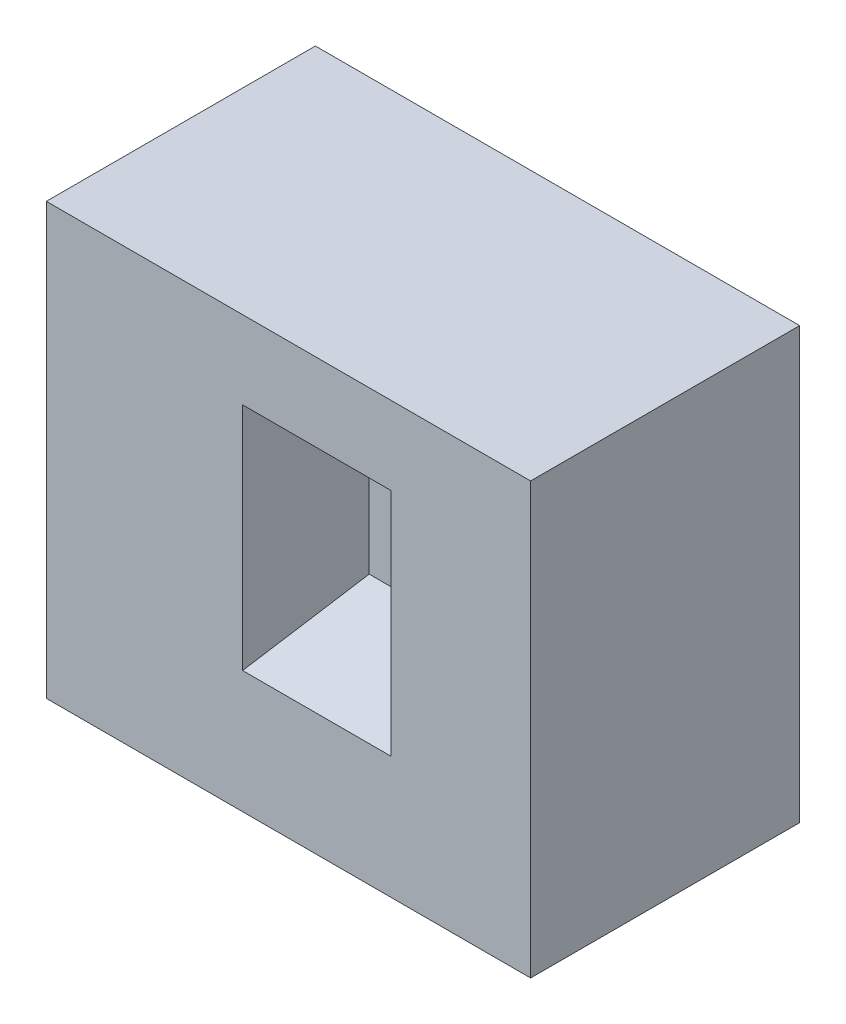
ISO-10303-21;
HEADER;
FILE_DESCRIPTION(('STEP AP214'),'2;1');
FILE_NAME('part.step','',(''),(''),'','','');
FILE_SCHEMA(('AUTOMOTIVE_DESIGN { 1 0 10303 214 1 1 1 1 }'));
ENDSEC;
DATA;
#1=APPLICATION_CONTEXT('core data for automotive mechanical design processes');
#2=APPLICATION_PROTOCOL_DEFINITION('international standard','automotive_design',2000,#1);
#3=PRODUCT_CONTEXT('',#1,'mechanical');
#4=PRODUCT('Part','Part','',(#3));
#5=PRODUCT_RELATED_PRODUCT_CATEGORY('part','',(#4));
#6=PRODUCT_DEFINITION_FORMATION('','',#4);
#7=PRODUCT_DEFINITION_CONTEXT('part definition',#1,'design');
#8=PRODUCT_DEFINITION('design','',#6,#7);
#9=PRODUCT_DEFINITION_SHAPE('','',#8);
#10=(LENGTH_UNIT() NAMED_UNIT(*) SI_UNIT(.MILLI.,.METRE.));
#11=(NAMED_UNIT(*) PLANE_ANGLE_UNIT() SI_UNIT($,.RADIAN.));
#12=(NAMED_UNIT(*) SI_UNIT($,.STERADIAN.) SOLID_ANGLE_UNIT());
#13=UNCERTAINTY_MEASURE_WITH_UNIT(LENGTH_MEASURE(1.E-05),#10,'distance_accuracy_value','');
#14=(GEOMETRIC_REPRESENTATION_CONTEXT(3) GLOBAL_UNCERTAINTY_ASSIGNED_CONTEXT((#13)) GLOBAL_UNIT_ASSIGNED_CONTEXT((#10,
#11,#12)) REPRESENTATION_CONTEXT('',''));
#15=CARTESIAN_POINT('',(0.,0.,0.));
#16=DIRECTION('',(0.,0.,1.));
#17=DIRECTION('',(1.,0.,0.));
#18=AXIS2_PLACEMENT_3D('',#15,#16,#17);
#19=CARTESIAN_POINT('',(0.,0.,25.));
#20=DIRECTION('',(1.,0.,0.));
#21=DIRECTION('',(0.,0.,-1.));
#22=AXIS2_PLACEMENT_3D('',#19,#20,#21);
#23=PLANE('',#22);
#24=DIRECTION('',(0.,-1.,0.));
#25=VECTOR('',#24,1.);
#26=CARTESIAN_POINT('',(0.,0.,-25.));
#27=LINE('',#26,#25);
#28=CARTESIAN_POINT('',(0.,80.,-25.));
#29=VERTEX_POINT('',#28);
#30=CARTESIAN_POINT('',(0.,0.,-25.));
#31=VERTEX_POINT('',#30);
#32=EDGE_CURVE('E121',#29,#31,#27,.T.);
#33=ORIENTED_EDGE('',*,*,#32,.T.);
#34=DIRECTION('',(0.,0.,-1.));
#35=VECTOR('',#34,1.);
#36=CARTESIAN_POINT('',(0.,0.,25.));
#37=LINE('',#36,#35);
#38=CARTESIAN_POINT('',(0.,0.,25.));
#39=VERTEX_POINT('',#38);
#40=EDGE_CURVE('E11',#39,#31,#37,.T.);
#41=ORIENTED_EDGE('',*,*,#40,.F.);
#42=DIRECTION('',(0.,-1.,0.));
#43=VECTOR('',#42,1.);
#44=CARTESIAN_POINT('',(0.,0.,25.));
#45=LINE('',#44,#43);
#46=CARTESIAN_POINT('',(0.,80.,25.));
#47=VERTEX_POINT('',#46);
#48=EDGE_CURVE('E116',#47,#39,#45,.T.);
#49=ORIENTED_EDGE('',*,*,#48,.F.);
#50=DIRECTION('',(0.,0.,-1.));
#51=VECTOR('',#50,1.);
#52=CARTESIAN_POINT('',(0.,80.,25.));
#53=LINE('',#52,#51);
#54=EDGE_CURVE('E111',#47,#29,#53,.T.);
#55=ORIENTED_EDGE('',*,*,#54,.T.);
#56=EDGE_LOOP('',(#33,#41,#49,#55));
#57=FACE_BOUND('',#56,.T.);
#58=ADVANCED_FACE('F30',(#57),#23,.F.);
#59=CARTESIAN_POINT('',(0.,0.,25.));
#60=DIRECTION('',(0.,1.,0.));
#61=DIRECTION('',(0.,0.,1.));
#62=AXIS2_PLACEMENT_3D('',#59,#60,#61);
#63=PLANE('',#62);
#64=DIRECTION('',(1.,0.,0.));
#65=VECTOR('',#64,1.);
#66=CARTESIAN_POINT('',(0.,0.,-25.));
#67=LINE('',#66,#65);
#68=CARTESIAN_POINT('',(90.,0.,-25.));
#69=VERTEX_POINT('',#68);
#70=EDGE_CURVE('E126',#31,#69,#67,.T.);
#71=ORIENTED_EDGE('',*,*,#70,.T.);
#72=DIRECTION('',(0.,0.,-1.));
#73=VECTOR('',#72,1.);
#74=CARTESIAN_POINT('',(90.,0.,25.));
#75=LINE('',#74,#73);
#76=CARTESIAN_POINT('',(90.,0.,25.));
#77=VERTEX_POINT('',#76);
#78=EDGE_CURVE('E40',#77,#69,#75,.T.);
#79=ORIENTED_EDGE('',*,*,#78,.F.);
#80=DIRECTION('',(1.,0.,0.));
#81=VECTOR('',#80,1.);
#82=CARTESIAN_POINT('',(0.,0.,25.));
#83=LINE('',#82,#81);
#84=EDGE_CURVE('E161',#39,#77,#83,.T.);
#85=ORIENTED_EDGE('',*,*,#84,.F.);
#86=ORIENTED_EDGE('',*,*,#40,.T.);
#87=EDGE_LOOP('',(#71,#79,#85,#86));
#88=FACE_BOUND('',#87,.T.);
#89=ADVANCED_FACE('F168',(#88),#63,.F.);
#90=CARTESIAN_POINT('',(90.,0.,25.));
#91=DIRECTION('',(-1.,0.,0.));
#92=DIRECTION('',(0.,0.,1.));
#93=AXIS2_PLACEMENT_3D('',#90,#91,#92);
#94=PLANE('',#93);
#95=DIRECTION('',(0.,1.,0.));
#96=VECTOR('',#95,1.);
#97=CARTESIAN_POINT('',(90.,0.,-25.));
#98=LINE('',#97,#96);
#99=CARTESIAN_POINT('',(90.,80.,-25.));
#100=VERTEX_POINT('',#99);
#101=EDGE_CURVE('E101',#69,#100,#98,.T.);
#102=ORIENTED_EDGE('',*,*,#101,.T.);
#103=DIRECTION('',(0.,0.,-1.));
#104=VECTOR('',#103,1.);
#105=CARTESIAN_POINT('',(90.,80.,25.));
#106=LINE('',#105,#104);
#107=CARTESIAN_POINT('',(90.,80.,25.));
#108=VERTEX_POINT('',#107);
#109=EDGE_CURVE('E113',#108,#100,#106,.T.);
#110=ORIENTED_EDGE('',*,*,#109,.F.);
#111=DIRECTION('',(0.,1.,0.));
#112=VECTOR('',#111,1.);
#113=CARTESIAN_POINT('',(90.,0.,25.));
#114=LINE('',#113,#112);
#115=EDGE_CURVE('E162',#77,#108,#114,.T.);
#116=ORIENTED_EDGE('',*,*,#115,.F.);
#117=ORIENTED_EDGE('',*,*,#78,.T.);
#118=EDGE_LOOP('',(#102,#110,#116,#117));
#119=FACE_BOUND('',#118,.T.);
#120=ADVANCED_FACE('F169',(#119),#94,.F.);
#121=CARTESIAN_POINT('',(0.,80.,25.));
#122=DIRECTION('',(0.,-1.,0.));
#123=DIRECTION('',(0.,0.,-1.));
#124=AXIS2_PLACEMENT_3D('',#121,#122,#123);
#125=PLANE('',#124);
#126=DIRECTION('',(-1.,0.,0.));
#127=VECTOR('',#126,1.);
#128=CARTESIAN_POINT('',(0.,80.,-25.));
#129=LINE('',#128,#127);
#130=EDGE_CURVE('E107',#100,#29,#129,.T.);
#131=ORIENTED_EDGE('',*,*,#130,.T.);
#132=ORIENTED_EDGE('',*,*,#54,.F.);
#133=DIRECTION('',(-1.,0.,0.));
#134=VECTOR('',#133,1.);
#135=CARTESIAN_POINT('',(0.,80.,25.));
#136=LINE('',#135,#134);
#137=EDGE_CURVE('E123',#108,#47,#136,.T.);
#138=ORIENTED_EDGE('',*,*,#137,.F.);
#139=ORIENTED_EDGE('',*,*,#109,.T.);
#140=EDGE_LOOP('',(#131,#132,#138,#139));
#141=FACE_BOUND('',#140,.T.);
#142=ADVANCED_FACE('F109',(#141),#125,.F.);
#143=CARTESIAN_POINT('',(0.,80.,25.));
#144=DIRECTION('',(0.,0.,-1.));
#145=DIRECTION('',(-1.,0.,0.));
#146=AXIS2_PLACEMENT_3D('',#143,#144,#145);
#147=PLANE('',#146);
#148=DIRECTION('',(-1.,0.,0.));
#149=VECTOR('',#148,1.);
#150=CARTESIAN_POINT('',(40.,22.7205953146759,25.));
#151=LINE('',#150,#149);
#152=CARTESIAN_POINT('',(36.4734603858307,22.7205953146759,25.));
#153=VERTEX_POINT('',#152);
#154=CARTESIAN_POINT('',(64.0528767018618,22.7205953146759,25.));
#155=VERTEX_POINT('',#154);
#156=EDGE_CURVE('E136',#153,#155,#151,.F.);
#157=ORIENTED_EDGE('',*,*,#156,.F.);
#158=DIRECTION('',(0.,1.,0.));
#159=VECTOR('',#158,1.);
#160=CARTESIAN_POINT('',(36.4734603858307,30.,25.));
#161=LINE('',#160,#159);
#162=CARTESIAN_POINT('',(36.4734603858307,65.4862769640608,25.));
#163=VERTEX_POINT('',#162);
#164=EDGE_CURVE('E49',#163,#153,#161,.F.);
#165=ORIENTED_EDGE('',*,*,#164,.F.);
#166=DIRECTION('',(1.,0.,0.));
#167=VECTOR('',#166,1.);
#168=CARTESIAN_POINT('',(40.,65.4862769640608,25.));
#169=LINE('',#168,#167);
#170=CARTESIAN_POINT('',(64.0528767018618,65.4862769640608,25.));
#171=VERTEX_POINT('',#170);
#172=EDGE_CURVE('E144',#171,#163,#169,.F.);
#173=ORIENTED_EDGE('',*,*,#172,.F.);
#174=DIRECTION('',(0.,-1.,0.));
#175=VECTOR('',#174,1.);
#176=CARTESIAN_POINT('',(64.0528767018618,30.,25.));
#177=LINE('',#176,#175);
#178=EDGE_CURVE('E139',#155,#171,#177,.F.);
#179=ORIENTED_EDGE('',*,*,#178,.F.);
#180=EDGE_LOOP('',(#157,#165,#173,#179));
#181=FACE_BOUND('',#180,.T.);
#182=ORIENTED_EDGE('',*,*,#48,.T.);
#183=ORIENTED_EDGE('',*,*,#84,.T.);
#184=ORIENTED_EDGE('',*,*,#115,.T.);
#185=ORIENTED_EDGE('',*,*,#137,.T.);
#186=EDGE_LOOP('',(#182,#183,#184,#185));
#187=FACE_BOUND('',#186,.T.);
#188=ADVANCED_FACE('F165',(#181,#187),#147,.F.);
#189=CARTESIAN_POINT('',(0.,80.,-25.));
#190=DIRECTION('',(0.,0.,-1.));
#191=DIRECTION('',(-1.,0.,0.));
#192=AXIS2_PLACEMENT_3D('',#189,#190,#191);
#193=PLANE('',#192);
#194=ORIENTED_EDGE('',*,*,#32,.F.);
#195=ORIENTED_EDGE('',*,*,#130,.F.);
#196=ORIENTED_EDGE('',*,*,#101,.F.);
#197=ORIENTED_EDGE('',*,*,#70,.F.);
#198=EDGE_LOOP('',(#194,#195,#196,#197));
#199=FACE_BOUND('',#198,.T.);
#200=ADVANCED_FACE('F125',(#199),#193,.T.);
#201=CARTESIAN_POINT('',(40.,30.,5.));
#202=DIRECTION('',(0.984807753012208,0.,0.173648177666931));
#203=DIRECTION('',(0.173648177666931,0.,-0.984807753012208));
#204=AXIS2_PLACEMENT_3D('',#201,#202,#203);
#205=PLANE('',#204);
#206=ORIENTED_EDGE('',*,*,#164,.T.);
#207=DIRECTION('',(-0.163464460888851,-0.337419706756525,0.92705302519255));
#208=VECTOR('',#207,1.);
#209=CARTESIAN_POINT('',(40.,30.,5.));
#210=LINE('',#209,#208);
#211=CARTESIAN_POINT('',(40.,30.,5.));
#212=VERTEX_POINT('',#211);
#213=EDGE_CURVE('E73',#212,#153,#210,.T.);
#214=ORIENTED_EDGE('',*,*,#213,.F.);
#215=DIRECTION('',(0.,-1.,0.));
#216=VECTOR('',#215,1.);
#217=CARTESIAN_POINT('',(40.,30.,5.));
#218=LINE('',#217,#216);
#219=CARTESIAN_POINT('',(40.,48.7042843405152,5.));
#220=VERTEX_POINT('',#219);
#221=EDGE_CURVE('E146',#220,#212,#218,.T.);
#222=ORIENTED_EDGE('',*,*,#221,.F.);
#223=DIRECTION('',(-0.133858692959642,0.637002796968528,0.7591503717798));
#224=VECTOR('',#223,1.);
#225=CARTESIAN_POINT('',(40.,48.7042843405152,5.));
#226=LINE('',#225,#224);
#227=EDGE_CURVE('E34',#220,#163,#226,.T.);
#228=ORIENTED_EDGE('',*,*,#227,.T.);
#229=EDGE_LOOP('',(#206,#214,#222,#228));
#230=FACE_BOUND('',#229,.T.);
#231=ADVANCED_FACE('F183',(#230),#205,.T.);
#232=CARTESIAN_POINT('',(40.,48.7042843405152,5.));
#233=DIRECTION('',(0.,-0.766044443118977,0.64278760968654));
#234=DIRECTION('',(0.,-0.64278760968654,-0.766044443118977));
#235=AXIS2_PLACEMENT_3D('',#232,#233,#234);
#236=PLANE('',#235);
#237=ORIENTED_EDGE('',*,*,#172,.T.);
#238=ORIENTED_EDGE('',*,*,#227,.F.);
#239=DIRECTION('',(-1.,0.,0.));
#240=VECTOR('',#239,1.);
#241=CARTESIAN_POINT('',(40.,48.7042843405152,5.));
#242=LINE('',#241,#240);
#243=CARTESIAN_POINT('',(52.5058713180692,48.7042843405152,5.));
#244=VERTEX_POINT('',#243);
#245=EDGE_CURVE('E142',#244,#220,#242,.T.);
#246=ORIENTED_EDGE('',*,*,#245,.F.);
#247=DIRECTION('',(0.404481746652007,0.587858883152556,0.700582935935476));
#248=VECTOR('',#247,1.);
#249=CARTESIAN_POINT('',(48.0584004826917,42.2404939228281,-2.7032454520546));
#250=LINE('',#249,#248);
#251=EDGE_CURVE('E66',#244,#171,#250,.T.);
#252=ORIENTED_EDGE('',*,*,#251,.T.);
#253=EDGE_LOOP('',(#237,#238,#246,#252));
#254=FACE_BOUND('',#253,.T.);
#255=ADVANCED_FACE('F32',(#254),#236,.T.);
#256=CARTESIAN_POINT('',(52.5058713180692,30.,5.));
#257=DIRECTION('',(-0.866025403784438,0.,0.500000000000001));
#258=DIRECTION('',(0.500000000000001,0.,0.866025403784438));
#259=AXIS2_PLACEMENT_3D('',#256,#257,#258);
#260=PLANE('',#259);
#261=ORIENTED_EDGE('',*,*,#178,.T.);
#262=ORIENTED_EDGE('',*,*,#251,.F.);
#263=DIRECTION('',(0.,1.,0.));
#264=VECTOR('',#263,1.);
#265=CARTESIAN_POINT('',(52.5058713180692,30.,5.));
#266=LINE('',#265,#264);
#267=CARTESIAN_POINT('',(52.5058713180692,30.,5.));
#268=VERTEX_POINT('',#267);
#269=EDGE_CURVE('E154',#268,#244,#266,.T.);
#270=ORIENTED_EDGE('',*,*,#269,.F.);
#271=DIRECTION('',(0.476870962711475,-0.300626578483223,0.825964736070555));
#272=VECTOR('',#271,1.);
#273=CARTESIAN_POINT('',(49.6619622071439,31.7928427863871,0.0742049277692742));
#274=LINE('',#273,#272);
#275=EDGE_CURVE('E141',#268,#155,#274,.T.);
#276=ORIENTED_EDGE('',*,*,#275,.T.);
#277=EDGE_LOOP('',(#261,#262,#270,#276));
#278=FACE_BOUND('',#277,.T.);
#279=ADVANCED_FACE('F189',(#278),#260,.T.);
#280=CARTESIAN_POINT('',(40.,30.,5.));
#281=DIRECTION('',(0.,0.939692620785908,0.342020143325669));
#282=DIRECTION('',(0.,-0.342020143325669,0.939692620785908));
#283=AXIS2_PLACEMENT_3D('',#280,#281,#282);
#284=PLANE('',#283);
#285=ORIENTED_EDGE('',*,*,#156,.T.);
#286=ORIENTED_EDGE('',*,*,#275,.F.);
#287=DIRECTION('',(1.,0.,0.));
#288=VECTOR('',#287,1.);
#289=CARTESIAN_POINT('',(40.,30.,5.));
#290=LINE('',#289,#288);
#291=EDGE_CURVE('E149',#212,#268,#290,.T.);
#292=ORIENTED_EDGE('',*,*,#291,.F.);
#293=ORIENTED_EDGE('',*,*,#213,.T.);
#294=EDGE_LOOP('',(#285,#286,#292,#293));
#295=FACE_BOUND('',#294,.T.);
#296=ADVANCED_FACE('F186',(#295),#284,.T.);
#297=CARTESIAN_POINT('',(40.,48.7042843405152,5.));
#298=DIRECTION('',(0.,0.,-1.));
#299=DIRECTION('',(-1.,0.,0.));
#300=AXIS2_PLACEMENT_3D('',#297,#298,#299);
#301=PLANE('',#300);
#302=ORIENTED_EDGE('',*,*,#221,.T.);
#303=ORIENTED_EDGE('',*,*,#291,.T.);
#304=ORIENTED_EDGE('',*,*,#269,.T.);
#305=ORIENTED_EDGE('',*,*,#245,.T.);
#306=EDGE_LOOP('',(#302,#303,#304,#305));
#307=FACE_BOUND('',#306,.T.);
#308=ADVANCED_FACE('F188',(#307),#301,.F.);
#309=CLOSED_SHELL('',(#58,#89,#120,#142,#188,#200,#231,#255,#279,#296,#308));
#310=MANIFOLD_SOLID_BREP('B2',#309);
#311=ADVANCED_BREP_SHAPE_REPRESENTATION('',(#18,#310),#14);
#312=SHAPE_DEFINITION_REPRESENTATION(#9,#311);
ENDSEC;
END-ISO-10303-21;
